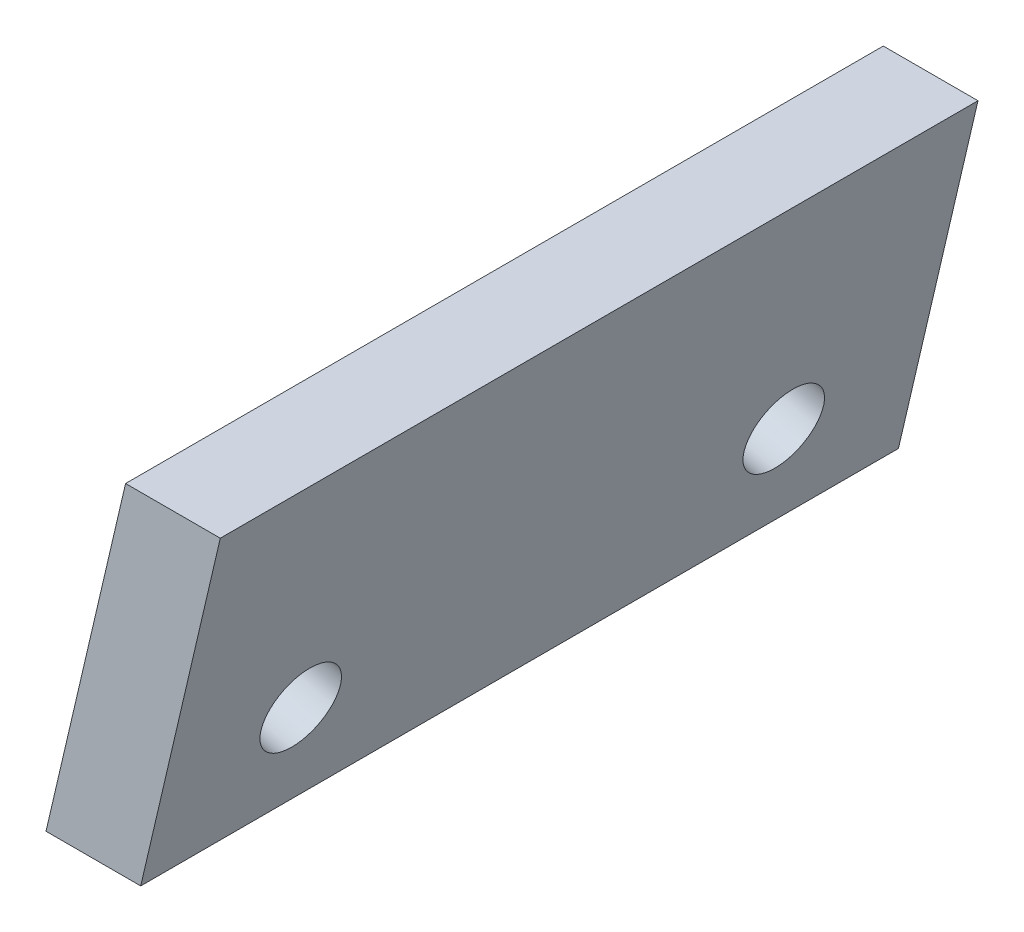
ISO-10303-21;
HEADER;
FILE_DESCRIPTION(('STEP AP214'),'2;1');
FILE_NAME('part.step','',(''),(''),'','','');
FILE_SCHEMA(('AUTOMOTIVE_DESIGN { 1 0 10303 214 1 1 1 1 }'));
ENDSEC;
DATA;
#1=APPLICATION_CONTEXT('core data for automotive mechanical design processes');
#2=APPLICATION_PROTOCOL_DEFINITION('international standard','automotive_design',2000,#1);
#3=PRODUCT_CONTEXT('',#1,'mechanical');
#4=PRODUCT('Part','Part','',(#3));
#5=PRODUCT_RELATED_PRODUCT_CATEGORY('part','',(#4));
#6=PRODUCT_DEFINITION_FORMATION('','',#4);
#7=PRODUCT_DEFINITION_CONTEXT('part definition',#1,'design');
#8=PRODUCT_DEFINITION('design','',#6,#7);
#9=PRODUCT_DEFINITION_SHAPE('','',#8);
#10=(LENGTH_UNIT() NAMED_UNIT(*) SI_UNIT(.MILLI.,.METRE.));
#11=(NAMED_UNIT(*) PLANE_ANGLE_UNIT() SI_UNIT($,.RADIAN.));
#12=(NAMED_UNIT(*) SI_UNIT($,.STERADIAN.) SOLID_ANGLE_UNIT());
#13=UNCERTAINTY_MEASURE_WITH_UNIT(LENGTH_MEASURE(1.E-05),#10,'distance_accuracy_value','');
#14=(GEOMETRIC_REPRESENTATION_CONTEXT(3) GLOBAL_UNCERTAINTY_ASSIGNED_CONTEXT((#13)) GLOBAL_UNIT_ASSIGNED_CONTEXT((#10,
#11,#12)) REPRESENTATION_CONTEXT('',''));
#15=CARTESIAN_POINT('',(0.,0.,0.));
#16=DIRECTION('',(0.,0.,1.));
#17=DIRECTION('',(1.,0.,0.));
#18=AXIS2_PLACEMENT_3D('',#15,#16,#17);
#19=CARTESIAN_POINT('',(0.,0.,20.));
#20=DIRECTION('',(0.97383605158167,-0.227251720873184,0.));
#21=DIRECTION('',(0.227251720873184,0.97383605158167,0.));
#22=AXIS2_PLACEMENT_3D('',#19,#20,#21);
#23=PLANE('',#22);
#24=CARTESIAN_POINT('',(0.727205506794188,3.11627536506134,3.625));
#25=DIRECTION('',(-0.97383605158167,0.227251720873184,0.));
#26=DIRECTION('',(-0.227251720873184,-0.97383605158167,0.));
#27=AXIS2_PLACEMENT_3D('',#24,#25,#26);
#28=CIRCLE('',#27,1.05);
#29=CARTESIAN_POINT('',(0.488591199877345,2.09374751090059,3.625));
#30=VERTEX_POINT('',#29);
#31=EDGE_CURVE('E108',#30,#30,#28,.T.);
#32=ORIENTED_EDGE('',*,*,#31,.F.);
#33=EDGE_LOOP('',(#32));
#34=FACE_BOUND('',#33,.T.);
#35=CARTESIAN_POINT('',(0.727205506794188,3.11627536506134,16.375));
#36=DIRECTION('',(-0.97383605158167,0.227251720873184,0.));
#37=DIRECTION('',(-0.227251720873184,-0.97383605158167,0.));
#38=AXIS2_PLACEMENT_3D('',#35,#36,#37);
#39=CIRCLE('',#38,1.05);
#40=CARTESIAN_POINT('',(0.488591199877345,2.09374751090059,16.375));
#41=VERTEX_POINT('',#40);
#42=EDGE_CURVE('E113',#41,#41,#39,.T.);
#43=ORIENTED_EDGE('',*,*,#42,.F.);
#44=EDGE_LOOP('',(#43));
#45=FACE_BOUND('',#44,.T.);
#46=DIRECTION('',(-0.227251720873184,-0.97383605158167,0.));
#47=VECTOR('',#46,1.);
#48=CARTESIAN_POINT('',(0.,0.,0.));
#49=LINE('',#48,#47);
#50=CARTESIAN_POINT('',(2.1002154156614,9.,0.));
#51=VERTEX_POINT('',#50);
#52=CARTESIAN_POINT('',(0.,0.,0.));
#53=VERTEX_POINT('',#52);
#54=EDGE_CURVE('E99',#51,#53,#49,.T.);
#55=ORIENTED_EDGE('',*,*,#54,.T.);
#56=DIRECTION('',(0.,0.,-1.));
#57=VECTOR('',#56,1.);
#58=CARTESIAN_POINT('',(0.,0.,20.));
#59=LINE('',#58,#57);
#60=CARTESIAN_POINT('',(0.,0.,20.));
#61=VERTEX_POINT('',#60);
#62=EDGE_CURVE('E11',#61,#53,#59,.T.);
#63=ORIENTED_EDGE('',*,*,#62,.F.);
#64=DIRECTION('',(-0.227251720873184,-0.97383605158167,0.));
#65=VECTOR('',#64,1.);
#66=CARTESIAN_POINT('',(0.,0.,20.));
#67=LINE('',#66,#65);
#68=CARTESIAN_POINT('',(2.1002154156614,9.,20.));
#69=VERTEX_POINT('',#68);
#70=EDGE_CURVE('E86',#69,#61,#67,.T.);
#71=ORIENTED_EDGE('',*,*,#70,.F.);
#72=DIRECTION('',(0.,0.,-1.));
#73=VECTOR('',#72,1.);
#74=CARTESIAN_POINT('',(2.1002154156614,9.,20.));
#75=LINE('',#74,#73);
#76=EDGE_CURVE('E95',#69,#51,#75,.T.);
#77=ORIENTED_EDGE('',*,*,#76,.T.);
#78=EDGE_LOOP('',(#55,#63,#71,#77));
#79=FACE_BOUND('',#78,.T.);
#80=ADVANCED_FACE('F33',(#34,#45,#79),#23,.F.);
#81=CARTESIAN_POINT('',(0.,0.,20.));
#82=DIRECTION('',(0.,1.,0.));
#83=DIRECTION('',(0.,0.,1.));
#84=AXIS2_PLACEMENT_3D('',#81,#82,#83);
#85=PLANE('',#84);
#86=DIRECTION('',(1.,0.,0.));
#87=VECTOR('',#86,1.);
#88=CARTESIAN_POINT('',(0.,0.,0.));
#89=LINE('',#88,#87);
#90=CARTESIAN_POINT('',(2.5,0.,0.));
#91=VERTEX_POINT('',#90);
#92=EDGE_CURVE('E90',#53,#91,#89,.T.);
#93=ORIENTED_EDGE('',*,*,#92,.T.);
#94=DIRECTION('',(0.,0.,-1.));
#95=VECTOR('',#94,1.);
#96=CARTESIAN_POINT('',(2.5,0.,20.));
#97=LINE('',#96,#95);
#98=CARTESIAN_POINT('',(2.5,0.,20.));
#99=VERTEX_POINT('',#98);
#100=EDGE_CURVE('E42',#99,#91,#97,.T.);
#101=ORIENTED_EDGE('',*,*,#100,.F.);
#102=DIRECTION('',(1.,0.,0.));
#103=VECTOR('',#102,1.);
#104=CARTESIAN_POINT('',(0.,0.,20.));
#105=LINE('',#104,#103);
#106=EDGE_CURVE('E81',#61,#99,#105,.T.);
#107=ORIENTED_EDGE('',*,*,#106,.F.);
#108=ORIENTED_EDGE('',*,*,#62,.T.);
#109=EDGE_LOOP('',(#93,#101,#107,#108));
#110=FACE_BOUND('',#109,.T.);
#111=ADVANCED_FACE('F89',(#110),#85,.F.);
#112=CARTESIAN_POINT('',(2.5,0.,20.));
#113=DIRECTION('',(-0.97383605158167,0.227251720873184,0.));
#114=DIRECTION('',(-0.227251720873184,-0.97383605158167,0.));
#115=AXIS2_PLACEMENT_3D('',#112,#113,#114);
#116=PLANE('',#115);
#117=CARTESIAN_POINT('',(3.09809714519463,2.56301056863564,3.625));
#118=DIRECTION('',(-0.97383605158167,0.227251720873184,0.));
#119=DIRECTION('',(-0.227251720873184,-0.97383605158167,0.));
#120=AXIS2_PLACEMENT_3D('',#117,#118,#119);
#121=CIRCLE('',#120,1.05);
#122=CARTESIAN_POINT('',(2.85948283827779,1.54048271447489,3.625));
#123=VERTEX_POINT('',#122);
#124=EDGE_CURVE('E36',#123,#123,#121,.T.);
#125=ORIENTED_EDGE('',*,*,#124,.T.);
#126=EDGE_LOOP('',(#125));
#127=FACE_BOUND('',#126,.T.);
#128=CARTESIAN_POINT('',(3.09809714519463,2.56301056863564,16.375));
#129=DIRECTION('',(-0.97383605158167,0.227251720873184,0.));
#130=DIRECTION('',(-0.227251720873184,-0.97383605158167,0.));
#131=AXIS2_PLACEMENT_3D('',#128,#129,#130);
#132=CIRCLE('',#131,1.05);
#133=CARTESIAN_POINT('',(2.85948283827779,1.54048271447489,16.375));
#134=VERTEX_POINT('',#133);
#135=EDGE_CURVE('E106',#134,#134,#132,.T.);
#136=ORIENTED_EDGE('',*,*,#135,.T.);
#137=EDGE_LOOP('',(#136));
#138=FACE_BOUND('',#137,.T.);
#139=DIRECTION('',(0.227251720873184,0.97383605158167,0.));
#140=VECTOR('',#139,1.);
#141=CARTESIAN_POINT('',(2.5,0.,0.));
#142=LINE('',#141,#140);
#143=CARTESIAN_POINT('',(4.6002154156614,9.,0.));
#144=VERTEX_POINT('',#143);
#145=EDGE_CURVE('E68',#91,#144,#142,.T.);
#146=ORIENTED_EDGE('',*,*,#145,.T.);
#147=DIRECTION('',(0.,0.,-1.));
#148=VECTOR('',#147,1.);
#149=CARTESIAN_POINT('',(4.6002154156614,9.,20.));
#150=LINE('',#149,#148);
#151=CARTESIAN_POINT('',(4.6002154156614,9.,20.));
#152=VERTEX_POINT('',#151);
#153=EDGE_CURVE('E91',#152,#144,#150,.T.);
#154=ORIENTED_EDGE('',*,*,#153,.F.);
#155=DIRECTION('',(0.227251720873184,0.97383605158167,0.));
#156=VECTOR('',#155,1.);
#157=CARTESIAN_POINT('',(2.5,0.,20.));
#158=LINE('',#157,#156);
#159=EDGE_CURVE('E84',#99,#152,#158,.T.);
#160=ORIENTED_EDGE('',*,*,#159,.F.);
#161=ORIENTED_EDGE('',*,*,#100,.T.);
#162=EDGE_LOOP('',(#146,#154,#160,#161));
#163=FACE_BOUND('',#162,.T.);
#164=ADVANCED_FACE('F93',(#127,#138,#163),#116,.F.);
#165=CARTESIAN_POINT('',(4.6002154156614,9.,20.));
#166=DIRECTION('',(0.,-1.,0.));
#167=DIRECTION('',(0.,0.,-1.));
#168=AXIS2_PLACEMENT_3D('',#165,#166,#167);
#169=PLANE('',#168);
#170=DIRECTION('',(-1.,0.,0.));
#171=VECTOR('',#170,1.);
#172=CARTESIAN_POINT('',(4.6002154156614,9.,0.));
#173=LINE('',#172,#171);
#174=EDGE_CURVE('E74',#144,#51,#173,.T.);
#175=ORIENTED_EDGE('',*,*,#174,.T.);
#176=ORIENTED_EDGE('',*,*,#76,.F.);
#177=DIRECTION('',(-1.,0.,0.));
#178=VECTOR('',#177,1.);
#179=CARTESIAN_POINT('',(4.6002154156614,9.,20.));
#180=LINE('',#179,#178);
#181=EDGE_CURVE('E51',#152,#69,#180,.T.);
#182=ORIENTED_EDGE('',*,*,#181,.F.);
#183=ORIENTED_EDGE('',*,*,#153,.T.);
#184=EDGE_LOOP('',(#175,#176,#182,#183));
#185=FACE_BOUND('',#184,.T.);
#186=ADVANCED_FACE('F138',(#185),#169,.F.);
#187=CARTESIAN_POINT('',(0.,0.,20.));
#188=DIRECTION('',(0.,0.,1.));
#189=DIRECTION('',(1.,0.,0.));
#190=AXIS2_PLACEMENT_3D('',#187,#188,#189);
#191=PLANE('',#190);
#192=ORIENTED_EDGE('',*,*,#70,.T.);
#193=ORIENTED_EDGE('',*,*,#106,.T.);
#194=ORIENTED_EDGE('',*,*,#159,.T.);
#195=ORIENTED_EDGE('',*,*,#181,.T.);
#196=EDGE_LOOP('',(#192,#193,#194,#195));
#197=FACE_BOUND('',#196,.T.);
#198=ADVANCED_FACE('F82',(#197),#191,.T.);
#199=CARTESIAN_POINT('',(0.,0.,0.));
#200=DIRECTION('',(0.,0.,1.));
#201=DIRECTION('',(1.,0.,0.));
#202=AXIS2_PLACEMENT_3D('',#199,#200,#201);
#203=PLANE('',#202);
#204=ORIENTED_EDGE('',*,*,#54,.F.);
#205=ORIENTED_EDGE('',*,*,#174,.F.);
#206=ORIENTED_EDGE('',*,*,#145,.F.);
#207=ORIENTED_EDGE('',*,*,#92,.F.);
#208=EDGE_LOOP('',(#204,#205,#206,#207));
#209=FACE_BOUND('',#208,.T.);
#210=ADVANCED_FACE('F129',(#209),#203,.F.);
#211=CARTESIAN_POINT('',(5.08985041232716,2.09822046687723,16.375));
#212=DIRECTION('',(-0.97383605158167,0.227251720873184,0.));
#213=DIRECTION('',(-0.227251720873184,-0.97383605158167,0.));
#214=AXIS2_PLACEMENT_3D('',#211,#212,#213);
#215=CYLINDRICAL_SURFACE('',#214,1.05);
#216=ORIENTED_EDGE('',*,*,#42,.T.);
#217=EDGE_LOOP('',(#216));
#218=FACE_BOUND('',#217,.T.);
#219=ORIENTED_EDGE('',*,*,#135,.F.);
#220=EDGE_LOOP('',(#219));
#221=FACE_BOUND('',#220,.T.);
#222=ADVANCED_FACE('F121',(#218,#221),#215,.F.);
#223=CARTESIAN_POINT('',(5.08985041232716,2.09822046687723,3.625));
#224=DIRECTION('',(-0.97383605158167,0.227251720873184,0.));
#225=DIRECTION('',(-0.227251720873184,-0.97383605158167,0.));
#226=AXIS2_PLACEMENT_3D('',#223,#224,#225);
#227=CYLINDRICAL_SURFACE('',#226,1.05);
#228=ORIENTED_EDGE('',*,*,#31,.T.);
#229=EDGE_LOOP('',(#228));
#230=FACE_BOUND('',#229,.T.);
#231=ORIENTED_EDGE('',*,*,#124,.F.);
#232=EDGE_LOOP('',(#231));
#233=FACE_BOUND('',#232,.T.);
#234=ADVANCED_FACE('F136',(#230,#233),#227,.F.);
#235=CLOSED_SHELL('',(#80,#111,#164,#186,#198,#210,#222,#234));
#236=MANIFOLD_SOLID_BREP('B2',#235);
#237=ADVANCED_BREP_SHAPE_REPRESENTATION('',(#18,#236),#14);
#238=SHAPE_DEFINITION_REPRESENTATION(#9,#237);
ENDSEC;
END-ISO-10303-21;
